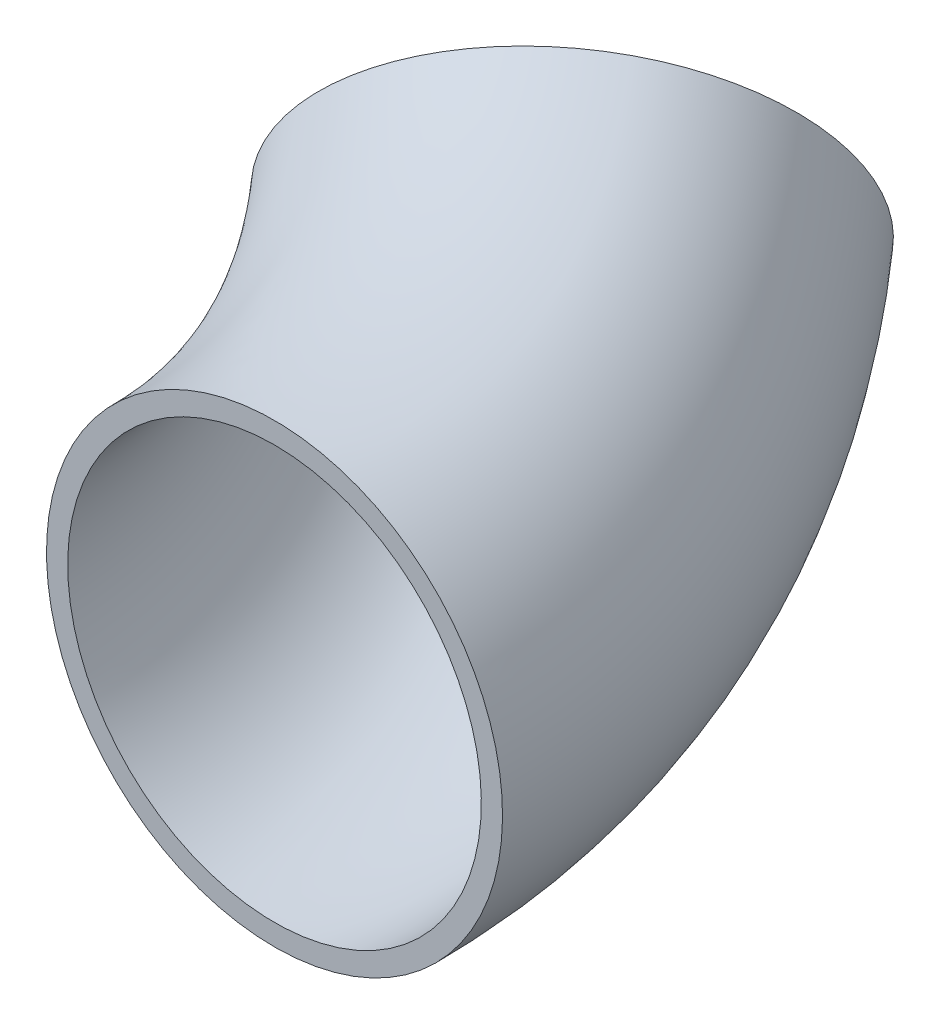
ISO-10303-21;
HEADER;
FILE_DESCRIPTION(('STEP AP214'),'2;1');
FILE_NAME('part.step','',(''),(''),'','','');
FILE_SCHEMA(('AUTOMOTIVE_DESIGN { 1 0 10303 214 1 1 1 1 }'));
ENDSEC;
DATA;
#1=APPLICATION_CONTEXT('core data for automotive mechanical design processes');
#2=APPLICATION_PROTOCOL_DEFINITION('international standard','automotive_design',2000,#1);
#3=PRODUCT_CONTEXT('',#1,'mechanical');
#4=PRODUCT('Part','Part','',(#3));
#5=PRODUCT_RELATED_PRODUCT_CATEGORY('part','',(#4));
#6=PRODUCT_DEFINITION_FORMATION('','',#4);
#7=PRODUCT_DEFINITION_CONTEXT('part definition',#1,'design');
#8=PRODUCT_DEFINITION('design','',#6,#7);
#9=PRODUCT_DEFINITION_SHAPE('','',#8);
#10=(LENGTH_UNIT() NAMED_UNIT(*) SI_UNIT(.MILLI.,.METRE.));
#11=(NAMED_UNIT(*) PLANE_ANGLE_UNIT() SI_UNIT($,.RADIAN.));
#12=(NAMED_UNIT(*) SI_UNIT($,.STERADIAN.) SOLID_ANGLE_UNIT());
#13=UNCERTAINTY_MEASURE_WITH_UNIT(LENGTH_MEASURE(1.E-05),#10,'distance_accuracy_value','');
#14=(GEOMETRIC_REPRESENTATION_CONTEXT(3) GLOBAL_UNCERTAINTY_ASSIGNED_CONTEXT((#13)) GLOBAL_UNIT_ASSIGNED_CONTEXT((#10,
#11,#12)) REPRESENTATION_CONTEXT('',''));
#15=CARTESIAN_POINT('',(0.,0.,0.));
#16=DIRECTION('',(0.,0.,1.));
#17=DIRECTION('',(1.,0.,0.));
#18=AXIS2_PLACEMENT_3D('',#15,#16,#17);
#19=CARTESIAN_POINT('',(-311.085197333455,219.970452561257,-1.77635683940025E-12));
#20=DIRECTION('',(-0.577350269189653,-0.816496580927707,0.));
#21=DIRECTION('',(0.816496580927707,-0.577350269189653,0.));
#22=AXIS2_PLACEMENT_3D('',#19,#20,#21);
#23=TOROIDAL_SURFACE('',#22,380.999999999999,136.525);
#24=CARTESIAN_POINT('',(-91.1147447722127,64.4278538945178,-269.407683632074));
#25=DIRECTION('',(0.577350269189612,-0.408248290463883,0.707106781186548));
#26=DIRECTION('',(0.804737854124374,0.138071187457702,-0.577350269189612));
#27=AXIS2_PLACEMENT_3D('',#24,#25,#26);
#28=CIRCLE('',#27,136.525);
#29=CARTESIAN_POINT('',(-12.2919992711006,8.69175603893596,-365.945436933567));
#30=VERTEX_POINT('',#29);
#31=EDGE_CURVE('E10',#30,#30,#28,.T.);
#32=CARTESIAN_POINT('',(0.,0.,0.));
#33=DIRECTION('',(0.,0.,1.));
#34=DIRECTION('',(1.,0.,0.));
#35=AXIS2_PLACEMENT_3D('',#32,#33,#34);
#36=CIRCLE('',#35,136.525);
#37=CARTESIAN_POINT('',(111.472195711155,-78.8227455011174,6.36527867451758E-13));
#38=VERTEX_POINT('',#37);
#39=EDGE_CURVE('E35',#38,#38,#36,.T.);
#40=CARTESIAN_POINT('',(-311.085197333455,219.970452561257,-1.77635683940025E-12));
#41=DIRECTION('',(-0.577350269189653,-0.816496580927707,0.));
#42=DIRECTION('',(0.816496580927707,-0.577350269189653,0.));
#43=AXIS2_PLACEMENT_3D('',#40,#41,#42);
#44=CIRCLE('',#43,517.524999999999);
#45=EDGE_CURVE('',#30,#38,#44,.T.);
#46=ORIENTED_EDGE('',*,*,#31,.T.);
#47=ORIENTED_EDGE('',*,*,#39,.F.);
#48=ORIENTED_EDGE('',*,*,#45,.T.);
#49=ORIENTED_EDGE('',*,*,#45,.F.);
#50=EDGE_LOOP('',(#46,#48,#47,#49));
#51=FACE_BOUND('',#50,.T.);
#52=ADVANCED_FACE('F29',(#51),#23,.T.);
#53=CARTESIAN_POINT('',(-91.1147447722127,64.4278538945178,-269.407683632074));
#54=DIRECTION('',(0.577350269189612,-0.408248290463883,0.707106781186548));
#55=DIRECTION('',(0.804737854124374,0.138071187457702,-0.577350269189612));
#56=AXIS2_PLACEMENT_3D('',#53,#54,#55);
#57=PLANE('',#56);
#58=CARTESIAN_POINT('',(-91.1147447722137,64.4278538945185,-269.407683632076));
#59=DIRECTION('',(0.577350269189612,-0.408248290463883,0.707106781186548));
#60=DIRECTION('',(0.774596669241491,0.,-0.632455532033667));
#61=AXIS2_PLACEMENT_3D('',#58,#59,#60);
#62=CIRCLE('',#61,123.825);
#63=CARTESIAN_POINT('',(-19.62434768981,13.8765093278282,-356.9651808125));
#64=VERTEX_POINT('',#63);
#65=EDGE_CURVE('E39',#64,#64,#62,.T.);
#66=ORIENTED_EDGE('',*,*,#65,.T.);
#67=EDGE_LOOP('',(#66));
#68=FACE_BOUND('',#67,.T.);
#69=ORIENTED_EDGE('',*,*,#31,.F.);
#70=EDGE_LOOP('',(#69));
#71=FACE_BOUND('',#70,.T.);
#72=ADVANCED_FACE('F53',(#68,#71),#57,.F.);
#73=CARTESIAN_POINT('',(0.,0.,0.));
#74=DIRECTION('',(0.,0.,1.));
#75=DIRECTION('',(1.,0.,0.));
#76=AXIS2_PLACEMENT_3D('',#73,#74,#75);
#77=PLANE('',#76);
#78=CARTESIAN_POINT('',(0.,0.,-1.77635683940025E-12));
#79=DIRECTION('',(0.,0.,1.));
#80=DIRECTION('',(1.,0.,0.));
#81=AXIS2_PLACEMENT_3D('',#78,#79,#80);
#82=CIRCLE('',#81,123.825);
#83=CARTESIAN_POINT('',(101.102689133373,-71.4903970824088,-1.77635683940025E-12));
#84=VERTEX_POINT('',#83);
#85=EDGE_CURVE('E43',#84,#84,#82,.T.);
#86=ORIENTED_EDGE('',*,*,#85,.F.);
#87=EDGE_LOOP('',(#86));
#88=FACE_BOUND('',#87,.T.);
#89=ORIENTED_EDGE('',*,*,#39,.T.);
#90=EDGE_LOOP('',(#89));
#91=FACE_BOUND('',#90,.T.);
#92=ADVANCED_FACE('F51',(#88,#91),#77,.T.);
#93=CARTESIAN_POINT('',(-311.085197333455,219.970452561257,-1.77635683940025E-12));
#94=DIRECTION('',(-0.577350269189653,-0.816496580927707,0.));
#95=DIRECTION('',(0.816496580927707,-0.577350269189653,0.));
#96=AXIS2_PLACEMENT_3D('',#93,#94,#95);
#97=TOROIDAL_SURFACE('',#96,380.999999999999,123.825);
#98=CARTESIAN_POINT('',(-311.085197333455,219.970452561257,-1.77635683940025E-12));
#99=DIRECTION('',(-0.577350269189653,-0.816496580927707,0.));
#100=DIRECTION('',(0.816496580927707,-0.577350269189653,0.));
#101=AXIS2_PLACEMENT_3D('',#98,#99,#100);
#102=CIRCLE('',#101,504.824999999999);
#103=EDGE_CURVE('',#64,#84,#102,.T.);
#104=ORIENTED_EDGE('',*,*,#65,.F.);
#105=ORIENTED_EDGE('',*,*,#85,.T.);
#106=ORIENTED_EDGE('',*,*,#103,.T.);
#107=ORIENTED_EDGE('',*,*,#103,.F.);
#108=EDGE_LOOP('',(#104,#106,#105,#107));
#109=FACE_BOUND('',#108,.T.);
#110=ADVANCED_FACE('F49',(#109),#97,.F.);
#111=CLOSED_SHELL('',(#52,#72,#92,#110));
#112=MANIFOLD_SOLID_BREP('B2',#111);
#113=ADVANCED_BREP_SHAPE_REPRESENTATION('',(#18,#112),#14);
#114=SHAPE_DEFINITION_REPRESENTATION(#9,#113);
ENDSEC;
END-ISO-10303-21;
